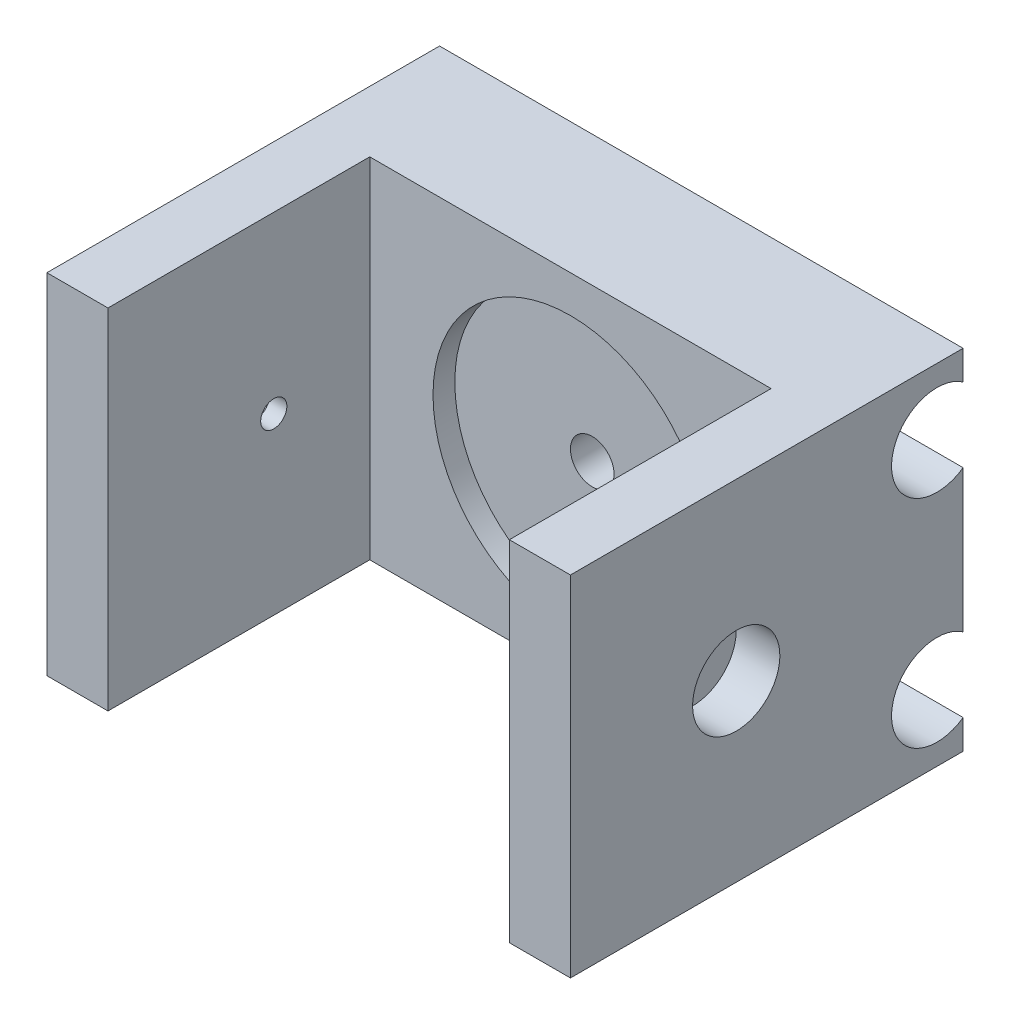
ISO-10303-21;
HEADER;
FILE_DESCRIPTION(('STEP AP214'),'2;1');
FILE_NAME('part.step','',(''),(''),'','','');
FILE_SCHEMA(('AUTOMOTIVE_DESIGN { 1 0 10303 214 1 1 1 1 }'));
ENDSEC;
DATA;
#1=APPLICATION_CONTEXT('core data for automotive mechanical design processes');
#2=APPLICATION_PROTOCOL_DEFINITION('international standard','automotive_design',2000,#1);
#3=PRODUCT_CONTEXT('',#1,'mechanical');
#4=PRODUCT('Part','Part','',(#3));
#5=PRODUCT_RELATED_PRODUCT_CATEGORY('part','',(#4));
#6=PRODUCT_DEFINITION_FORMATION('','',#4);
#7=PRODUCT_DEFINITION_CONTEXT('part definition',#1,'design');
#8=PRODUCT_DEFINITION('design','',#6,#7);
#9=PRODUCT_DEFINITION_SHAPE('','',#8);
#10=(LENGTH_UNIT() NAMED_UNIT(*) SI_UNIT(.MILLI.,.METRE.));
#11=(NAMED_UNIT(*) PLANE_ANGLE_UNIT() SI_UNIT($,.RADIAN.));
#12=(NAMED_UNIT(*) SI_UNIT($,.STERADIAN.) SOLID_ANGLE_UNIT());
#13=UNCERTAINTY_MEASURE_WITH_UNIT(LENGTH_MEASURE(1.E-05),#10,'distance_accuracy_value','');
#14=(GEOMETRIC_REPRESENTATION_CONTEXT(3) GLOBAL_UNCERTAINTY_ASSIGNED_CONTEXT((#13)) GLOBAL_UNIT_ASSIGNED_CONTEXT((#10,
#11,#12)) REPRESENTATION_CONTEXT('',''));
#15=CARTESIAN_POINT('',(0.,0.,0.));
#16=DIRECTION('',(0.,0.,1.));
#17=DIRECTION('',(1.,0.,0.));
#18=AXIS2_PLACEMENT_3D('',#15,#16,#17);
#19=CARTESIAN_POINT('',(12.2222222222222,0.915032679738576,45.));
#20=DIRECTION('',(0.,0.,-1.));
#21=DIRECTION('',(-1.,0.,0.));
#22=AXIS2_PLACEMENT_3D('',#19,#20,#21);
#23=CYLINDRICAL_SURFACE('',#22,2.5);
#24=CARTESIAN_POINT('',(12.2222222222222,0.915032679738576,4.));
#25=DIRECTION('',(0.,0.,-1.));
#26=DIRECTION('',(-1.,0.,0.));
#27=AXIS2_PLACEMENT_3D('',#24,#25,#26);
#28=CIRCLE('',#27,2.5);
#29=CARTESIAN_POINT('',(9.72222222222224,0.915032679738576,4.));
#30=VERTEX_POINT('',#29);
#31=EDGE_CURVE('E277',#30,#30,#28,.T.);
#32=ORIENTED_EDGE('',*,*,#31,.T.);
#33=EDGE_LOOP('',(#32));
#34=FACE_BOUND('',#33,.T.);
#35=CARTESIAN_POINT('',(12.2222222222222,0.915032679738576,12.5));
#36=DIRECTION('',(0.,0.,1.));
#37=DIRECTION('',(1.,0.,0.));
#38=AXIS2_PLACEMENT_3D('',#35,#36,#37);
#39=CIRCLE('',#38,2.5);
#40=CARTESIAN_POINT('',(14.7222222222222,0.915032679738576,12.5));
#41=VERTEX_POINT('',#40);
#42=EDGE_CURVE('E274',#41,#41,#39,.F.);
#43=ORIENTED_EDGE('',*,*,#42,.F.);
#44=EDGE_LOOP('',(#43));
#45=FACE_BOUND('',#44,.T.);
#46=ADVANCED_FACE('F49',(#34,#45),#23,.F.);
#47=CARTESIAN_POINT('',(0.,0.,0.));
#48=DIRECTION('',(0.,0.,1.));
#49=DIRECTION('',(1.,0.,0.));
#50=AXIS2_PLACEMENT_3D('',#47,#48,#49);
#51=PLANE('',#50);
#52=DIRECTION('',(0.,-1.,0.));
#53=VECTOR('',#52,1.);
#54=CARTESIAN_POINT('',(-17.7777777777778,20.9150326797386,0.));
#55=LINE('',#54,#53);
#56=CARTESIAN_POINT('',(-17.7777777777778,-15.7323194365805,0.));
#57=VERTEX_POINT('',#56);
#58=CARTESIAN_POINT('',(-17.7777777777778,-19.0849673202614,0.));
#59=VERTEX_POINT('',#58);
#60=EDGE_CURVE('E148',#57,#59,#55,.T.);
#61=ORIENTED_EDGE('',*,*,#60,.F.);
#62=DIRECTION('',(1.,0.,0.));
#63=VECTOR('',#62,1.);
#64=CARTESIAN_POINT('',(-20.7777777777778,-15.7323194365805,0.));
#65=LINE('',#64,#63);
#66=CARTESIAN_POINT('',(42.2222222222222,-15.7323194365805,0.));
#67=VERTEX_POINT('',#66);
#68=EDGE_CURVE('E11',#57,#67,#65,.T.);
#69=ORIENTED_EDGE('',*,*,#68,.T.);
#70=DIRECTION('',(0.,1.,0.));
#71=VECTOR('',#70,1.);
#72=CARTESIAN_POINT('',(42.2222222222222,20.9150326797386,0.));
#73=LINE('',#72,#71);
#74=CARTESIAN_POINT('',(42.2222222222222,-19.0849673202614,0.));
#75=VERTEX_POINT('',#74);
#76=EDGE_CURVE('E249',#75,#67,#73,.T.);
#77=ORIENTED_EDGE('',*,*,#76,.F.);
#78=DIRECTION('',(1.,0.,0.));
#79=VECTOR('',#78,1.);
#80=CARTESIAN_POINT('',(-17.7777777777778,-19.0849673202614,0.));
#81=LINE('',#80,#79);
#82=EDGE_CURVE('E244',#59,#75,#81,.T.);
#83=ORIENTED_EDGE('',*,*,#82,.F.);
#84=EDGE_LOOP('',(#61,#69,#77,#83));
#85=FACE_BOUND('',#84,.T.);
#86=ADVANCED_FACE('F329',(#85),#51,.F.);
#87=CARTESIAN_POINT('',(12.2222222222222,0.915032679738576,0.));
#88=DIRECTION('',(0.,0.,-1.));
#89=DIRECTION('',(-1.,0.,0.));
#90=AXIS2_PLACEMENT_3D('',#87,#88,#89);
#91=CIRCLE('',#90,5.);
#92=CARTESIAN_POINT('',(7.22222222222224,0.915032679738576,0.));
#93=VERTEX_POINT('',#92);
#94=EDGE_CURVE('E284',#93,#93,#91,.T.);
#95=ORIENTED_EDGE('',*,*,#94,.F.);
#96=EDGE_LOOP('',(#95));
#97=FACE_BOUND('',#96,.T.);
#98=CARTESIAN_POINT('',(42.2222222222222,-7.23761520394236,0.));
#99=VERTEX_POINT('',#98);
#100=CARTESIAN_POINT('',(42.2222222222222,9.06768056341952,0.));
#101=VERTEX_POINT('',#100);
#102=EDGE_CURVE('E253',#99,#101,#73,.T.);
#103=ORIENTED_EDGE('',*,*,#102,.F.);
#104=DIRECTION('',(1.,0.,0.));
#105=VECTOR('',#104,1.);
#106=CARTESIAN_POINT('',(-20.7777777777778,-7.23761520394237,0.));
#107=LINE('',#106,#105);
#108=CARTESIAN_POINT('',(-17.7777777777778,-7.23761520394236,0.));
#109=VERTEX_POINT('',#108);
#110=EDGE_CURVE('E59',#99,#109,#107,.F.);
#111=ORIENTED_EDGE('',*,*,#110,.T.);
#112=CARTESIAN_POINT('',(-17.7777777777778,9.06768056341951,0.));
#113=VERTEX_POINT('',#112);
#114=EDGE_CURVE('E245',#113,#109,#55,.T.);
#115=ORIENTED_EDGE('',*,*,#114,.F.);
#116=DIRECTION('',(1.,0.,0.));
#117=VECTOR('',#116,1.);
#118=CARTESIAN_POINT('',(-20.7777777777778,9.06768056341951,0.));
#119=LINE('',#118,#117);
#120=EDGE_CURVE('E268',#113,#101,#119,.T.);
#121=ORIENTED_EDGE('',*,*,#120,.T.);
#122=EDGE_LOOP('',(#103,#111,#115,#121));
#123=FACE_BOUND('',#122,.T.);
#124=ADVANCED_FACE('F337',(#97,#123),#51,.F.);
#125=CARTESIAN_POINT('',(-17.7777777777778,20.9150326797386,15.));
#126=DIRECTION('',(1.,0.,0.));
#127=DIRECTION('',(0.,0.,-1.));
#128=AXIS2_PLACEMENT_3D('',#125,#126,#127);
#129=PLANE('',#128);
#130=CARTESIAN_POINT('',(-17.7777777777778,0.915032679738565,26.));
#131=DIRECTION('',(1.,0.,0.));
#132=DIRECTION('',(0.,1.,0.));
#133=AXIS2_PLACEMENT_3D('',#130,#131,#132);
#134=CIRCLE('',#133,5.);
#135=CARTESIAN_POINT('',(-17.7777777777778,5.91503267973857,26.));
#136=VERTEX_POINT('',#135);
#137=EDGE_CURVE('E302',#136,#136,#134,.T.);
#138=ORIENTED_EDGE('',*,*,#137,.T.);
#139=EDGE_LOOP('',(#138));
#140=FACE_BOUND('',#139,.T.);
#141=ORIENTED_EDGE('',*,*,#114,.T.);
#142=CARTESIAN_POINT('',(-17.7777777777778,-11.4849673202614,3.));
#143=DIRECTION('',(1.,0.,0.));
#144=DIRECTION('',(0.,0.,-1.));
#145=AXIS2_PLACEMENT_3D('',#142,#143,#144);
#146=CIRCLE('',#145,5.2);
#147=EDGE_CURVE('E230',#109,#57,#146,.T.);
#148=ORIENTED_EDGE('',*,*,#147,.T.);
#149=ORIENTED_EDGE('',*,*,#60,.T.);
#150=DIRECTION('',(0.,0.,-1.));
#151=VECTOR('',#150,1.);
#152=CARTESIAN_POINT('',(-17.7777777777778,-19.0849673202614,15.));
#153=LINE('',#152,#151);
#154=CARTESIAN_POINT('',(-17.7777777777778,-19.0849673202614,45.));
#155=VERTEX_POINT('',#154);
#156=EDGE_CURVE('E140',#155,#59,#153,.T.);
#157=ORIENTED_EDGE('',*,*,#156,.F.);
#158=DIRECTION('',(0.,1.,0.));
#159=VECTOR('',#158,1.);
#160=CARTESIAN_POINT('',(-17.7777777777778,20.9150326797386,45.));
#161=LINE('',#160,#159);
#162=CARTESIAN_POINT('',(-17.7777777777778,20.9150326797386,45.));
#163=VERTEX_POINT('',#162);
#164=EDGE_CURVE('E144',#155,#163,#161,.T.);
#165=ORIENTED_EDGE('',*,*,#164,.T.);
#166=DIRECTION('',(0.,0.,-1.));
#167=VECTOR('',#166,1.);
#168=CARTESIAN_POINT('',(-17.7777777777778,20.9150326797386,15.));
#169=LINE('',#168,#167);
#170=CARTESIAN_POINT('',(-17.7777777777778,20.9150326797386,0.));
#171=VERTEX_POINT('',#170);
#172=EDGE_CURVE('E239',#163,#171,#169,.T.);
#173=ORIENTED_EDGE('',*,*,#172,.T.);
#174=CARTESIAN_POINT('',(-17.7777777777778,17.5623847960576,0.));
#175=VERTEX_POINT('',#174);
#176=EDGE_CURVE('E240',#171,#175,#55,.T.);
#177=ORIENTED_EDGE('',*,*,#176,.T.);
#178=CARTESIAN_POINT('',(-17.7777777777778,13.3150326797386,3.));
#179=DIRECTION('',(1.,0.,0.));
#180=DIRECTION('',(0.,0.,-1.));
#181=AXIS2_PLACEMENT_3D('',#178,#179,#180);
#182=CIRCLE('',#181,5.2);
#183=EDGE_CURVE('E224',#175,#113,#182,.T.);
#184=ORIENTED_EDGE('',*,*,#183,.T.);
#185=EDGE_LOOP('',(#141,#148,#149,#157,#165,#173,#177,#184));
#186=FACE_BOUND('',#185,.T.);
#187=ADVANCED_FACE('F51',(#140,#186),#129,.F.);
#188=CARTESIAN_POINT('',(-17.7777777777778,-19.0849673202614,15.));
#189=DIRECTION('',(0.,1.,0.));
#190=DIRECTION('',(-1.,0.,0.));
#191=AXIS2_PLACEMENT_3D('',#188,#189,#190);
#192=PLANE('',#191);
#193=ORIENTED_EDGE('',*,*,#82,.T.);
#194=DIRECTION('',(0.,0.,-1.));
#195=VECTOR('',#194,1.);
#196=CARTESIAN_POINT('',(42.2222222222222,-19.0849673202614,15.));
#197=LINE('',#196,#195);
#198=CARTESIAN_POINT('',(42.2222222222222,-19.0849673202614,45.));
#199=VERTEX_POINT('',#198);
#200=EDGE_CURVE('E154',#199,#75,#197,.T.);
#201=ORIENTED_EDGE('',*,*,#200,.F.);
#202=DIRECTION('',(1.,0.,0.));
#203=VECTOR('',#202,1.);
#204=CARTESIAN_POINT('',(42.2222222222222,-19.0849673202614,45.));
#205=LINE('',#204,#203);
#206=CARTESIAN_POINT('',(35.2222222222222,-19.0849673202614,45.));
#207=VERTEX_POINT('',#206);
#208=EDGE_CURVE('E205',#207,#199,#205,.T.);
#209=ORIENTED_EDGE('',*,*,#208,.F.);
#210=DIRECTION('',(0.,0.,-1.));
#211=VECTOR('',#210,1.);
#212=CARTESIAN_POINT('',(35.2222222222222,-19.0849673202614,45.));
#213=LINE('',#212,#211);
#214=CARTESIAN_POINT('',(35.2222222222222,-19.0849673202614,15.));
#215=VERTEX_POINT('',#214);
#216=EDGE_CURVE('E209',#207,#215,#213,.T.);
#217=ORIENTED_EDGE('',*,*,#216,.T.);
#218=DIRECTION('',(1.,0.,0.));
#219=VECTOR('',#218,1.);
#220=CARTESIAN_POINT('',(-17.7777777777778,-19.0849673202614,15.));
#221=LINE('',#220,#219);
#222=CARTESIAN_POINT('',(-10.7777777777778,-19.0849673202614,15.));
#223=VERTEX_POINT('',#222);
#224=EDGE_CURVE('E233',#223,#215,#221,.T.);
#225=ORIENTED_EDGE('',*,*,#224,.F.);
#226=DIRECTION('',(0.,0.,-1.));
#227=VECTOR('',#226,1.);
#228=CARTESIAN_POINT('',(-10.7777777777778,-19.0849673202614,45.));
#229=LINE('',#228,#227);
#230=CARTESIAN_POINT('',(-10.7777777777778,-19.0849673202614,45.));
#231=VERTEX_POINT('',#230);
#232=EDGE_CURVE('E168',#231,#223,#229,.T.);
#233=ORIENTED_EDGE('',*,*,#232,.F.);
#234=DIRECTION('',(-1.,0.,0.));
#235=VECTOR('',#234,1.);
#236=CARTESIAN_POINT('',(-17.7777777777778,-19.0849673202614,45.));
#237=LINE('',#236,#235);
#238=EDGE_CURVE('E160',#231,#155,#237,.T.);
#239=ORIENTED_EDGE('',*,*,#238,.T.);
#240=ORIENTED_EDGE('',*,*,#156,.T.);
#241=EDGE_LOOP('',(#193,#201,#209,#217,#225,#233,#239,#240));
#242=FACE_BOUND('',#241,.T.);
#243=ADVANCED_FACE('F166',(#242),#192,.F.);
#244=CARTESIAN_POINT('',(42.2222222222222,20.9150326797386,15.));
#245=DIRECTION('',(-1.,0.,0.));
#246=DIRECTION('',(0.,-1.,0.));
#247=AXIS2_PLACEMENT_3D('',#244,#245,#246);
#248=PLANE('',#247);
#249=CARTESIAN_POINT('',(42.2222222222222,0.915032679738576,26.));
#250=DIRECTION('',(1.,0.,0.));
#251=DIRECTION('',(0.,1.,0.));
#252=AXIS2_PLACEMENT_3D('',#249,#250,#251);
#253=CIRCLE('',#252,5.);
#254=CARTESIAN_POINT('',(42.2222222222222,5.91503267973858,26.));
#255=VERTEX_POINT('',#254);
#256=EDGE_CURVE('E186',#255,#255,#253,.T.);
#257=ORIENTED_EDGE('',*,*,#256,.F.);
#258=EDGE_LOOP('',(#257));
#259=FACE_BOUND('',#258,.T.);
#260=ORIENTED_EDGE('',*,*,#76,.T.);
#261=CARTESIAN_POINT('',(42.2222222222222,-11.4849673202614,3.));
#262=DIRECTION('',(1.,0.,0.));
#263=DIRECTION('',(0.,1.,0.));
#264=AXIS2_PLACEMENT_3D('',#261,#262,#263);
#265=CIRCLE('',#264,5.2);
#266=EDGE_CURVE('E221',#99,#67,#265,.T.);
#267=ORIENTED_EDGE('',*,*,#266,.F.);
#268=ORIENTED_EDGE('',*,*,#102,.T.);
#269=CARTESIAN_POINT('',(42.2222222222222,13.3150326797386,3.));
#270=DIRECTION('',(1.,0.,0.));
#271=DIRECTION('',(0.,1.,0.));
#272=AXIS2_PLACEMENT_3D('',#269,#270,#271);
#273=CIRCLE('',#272,5.2);
#274=CARTESIAN_POINT('',(42.2222222222222,17.5623847960576,0.));
#275=VERTEX_POINT('',#274);
#276=EDGE_CURVE('E220',#275,#101,#273,.T.);
#277=ORIENTED_EDGE('',*,*,#276,.F.);
#278=CARTESIAN_POINT('',(42.2222222222222,20.9150326797386,0.));
#279=VERTEX_POINT('',#278);
#280=EDGE_CURVE('E248',#275,#279,#73,.T.);
#281=ORIENTED_EDGE('',*,*,#280,.T.);
#282=DIRECTION('',(0.,0.,-1.));
#283=VECTOR('',#282,1.);
#284=CARTESIAN_POINT('',(42.2222222222222,20.9150326797386,15.));
#285=LINE('',#284,#283);
#286=CARTESIAN_POINT('',(42.2222222222222,20.9150326797386,45.));
#287=VERTEX_POINT('',#286);
#288=EDGE_CURVE('E258',#287,#279,#285,.T.);
#289=ORIENTED_EDGE('',*,*,#288,.F.);
#290=DIRECTION('',(0.,1.,0.));
#291=VECTOR('',#290,1.);
#292=CARTESIAN_POINT('',(42.2222222222222,20.9150326797386,45.));
#293=LINE('',#292,#291);
#294=EDGE_CURVE('E195',#199,#287,#293,.T.);
#295=ORIENTED_EDGE('',*,*,#294,.F.);
#296=ORIENTED_EDGE('',*,*,#200,.T.);
#297=EDGE_LOOP('',(#260,#267,#268,#277,#281,#289,#295,#296));
#298=FACE_BOUND('',#297,.T.);
#299=ADVANCED_FACE('F368',(#259,#298),#248,.F.);
#300=CARTESIAN_POINT('',(-17.7777777777778,20.9150326797386,15.));
#301=DIRECTION('',(0.,-1.,0.));
#302=DIRECTION('',(0.,0.,-1.));
#303=AXIS2_PLACEMENT_3D('',#300,#301,#302);
#304=PLANE('',#303);
#305=DIRECTION('',(-1.,0.,0.));
#306=VECTOR('',#305,1.);
#307=CARTESIAN_POINT('',(-17.7777777777778,20.9150326797386,0.));
#308=LINE('',#307,#306);
#309=EDGE_CURVE('E236',#279,#171,#308,.T.);
#310=ORIENTED_EDGE('',*,*,#309,.T.);
#311=ORIENTED_EDGE('',*,*,#172,.F.);
#312=DIRECTION('',(1.,0.,0.));
#313=VECTOR('',#312,1.);
#314=CARTESIAN_POINT('',(-17.7777777777778,20.9150326797386,45.));
#315=LINE('',#314,#313);
#316=CARTESIAN_POINT('',(-10.7777777777778,20.9150326797386,45.));
#317=VERTEX_POINT('',#316);
#318=EDGE_CURVE('E163',#163,#317,#315,.T.);
#319=ORIENTED_EDGE('',*,*,#318,.T.);
#320=DIRECTION('',(0.,0.,-1.));
#321=VECTOR('',#320,1.);
#322=CARTESIAN_POINT('',(-10.7777777777778,20.9150326797386,45.));
#323=LINE('',#322,#321);
#324=CARTESIAN_POINT('',(-10.7777777777778,20.9150326797386,15.));
#325=VERTEX_POINT('',#324);
#326=EDGE_CURVE('E178',#317,#325,#323,.T.);
#327=ORIENTED_EDGE('',*,*,#326,.T.);
#328=DIRECTION('',(-1.,0.,0.));
#329=VECTOR('',#328,1.);
#330=CARTESIAN_POINT('',(-17.7777777777778,20.9150326797386,15.));
#331=LINE('',#330,#329);
#332=CARTESIAN_POINT('',(35.2222222222222,20.9150326797386,15.));
#333=VERTEX_POINT('',#332);
#334=EDGE_CURVE('E72',#333,#325,#331,.T.);
#335=ORIENTED_EDGE('',*,*,#334,.F.);
#336=DIRECTION('',(0.,0.,-1.));
#337=VECTOR('',#336,1.);
#338=CARTESIAN_POINT('',(35.2222222222222,20.9150326797386,45.));
#339=LINE('',#338,#337);
#340=CARTESIAN_POINT('',(35.2222222222222,20.9150326797386,45.));
#341=VERTEX_POINT('',#340);
#342=EDGE_CURVE('E216',#341,#333,#339,.T.);
#343=ORIENTED_EDGE('',*,*,#342,.F.);
#344=DIRECTION('',(-1.,0.,0.));
#345=VECTOR('',#344,1.);
#346=CARTESIAN_POINT('',(42.2222222222222,20.9150326797386,45.));
#347=LINE('',#346,#345);
#348=EDGE_CURVE('E199',#287,#341,#347,.T.);
#349=ORIENTED_EDGE('',*,*,#348,.F.);
#350=ORIENTED_EDGE('',*,*,#288,.T.);
#351=EDGE_LOOP('',(#310,#311,#319,#327,#335,#343,#349,#350));
#352=FACE_BOUND('',#351,.T.);
#353=ADVANCED_FACE('F374',(#352),#304,.F.);
#354=CARTESIAN_POINT('',(0.,0.,15.));
#355=DIRECTION('',(0.,0.,1.));
#356=DIRECTION('',(1.,0.,0.));
#357=AXIS2_PLACEMENT_3D('',#354,#355,#356);
#358=PLANE('',#357);
#359=CARTESIAN_POINT('',(12.2222222222222,0.915032679738576,15.));
#360=DIRECTION('',(0.,0.,1.));
#361=DIRECTION('',(1.,0.,0.));
#362=AXIS2_PLACEMENT_3D('',#359,#360,#361);
#363=CIRCLE('',#362,15.75);
#364=CARTESIAN_POINT('',(27.9722222222222,0.915032679738576,15.));
#365=VERTEX_POINT('',#364);
#366=EDGE_CURVE('E287',#365,#365,#363,.T.);
#367=ORIENTED_EDGE('',*,*,#366,.F.);
#368=EDGE_LOOP('',(#367));
#369=FACE_BOUND('',#368,.T.);
#370=DIRECTION('',(0.,-1.,0.));
#371=VECTOR('',#370,1.);
#372=CARTESIAN_POINT('',(-10.7777777777778,20.9150326797386,15.));
#373=LINE('',#372,#371);
#374=EDGE_CURVE('E67',#325,#223,#373,.T.);
#375=ORIENTED_EDGE('',*,*,#374,.T.);
#376=ORIENTED_EDGE('',*,*,#224,.T.);
#377=DIRECTION('',(0.,-1.,0.));
#378=VECTOR('',#377,1.);
#379=CARTESIAN_POINT('',(35.2222222222222,20.9150326797386,15.));
#380=LINE('',#379,#378);
#381=EDGE_CURVE('E191',#333,#215,#380,.T.);
#382=ORIENTED_EDGE('',*,*,#381,.F.);
#383=ORIENTED_EDGE('',*,*,#334,.T.);
#384=EDGE_LOOP('',(#375,#376,#382,#383));
#385=FACE_BOUND('',#384,.T.);
#386=ADVANCED_FACE('F409',(#369,#385),#358,.T.);
#387=ORIENTED_EDGE('',*,*,#280,.F.);
#388=DIRECTION('',(1.,0.,0.));
#389=VECTOR('',#388,1.);
#390=CARTESIAN_POINT('',(-20.7777777777778,17.5623847960576,0.));
#391=LINE('',#390,#389);
#392=EDGE_CURVE('E153',#275,#175,#391,.F.);
#393=ORIENTED_EDGE('',*,*,#392,.T.);
#394=ORIENTED_EDGE('',*,*,#176,.F.);
#395=ORIENTED_EDGE('',*,*,#309,.F.);
#396=EDGE_LOOP('',(#387,#393,#394,#395));
#397=FACE_BOUND('',#396,.T.);
#398=ADVANCED_FACE('F340',(#397),#51,.F.);
#399=CARTESIAN_POINT('',(-20.7777777777778,13.3150326797386,3.));
#400=DIRECTION('',(1.,0.,0.));
#401=DIRECTION('',(0.,1.,0.));
#402=AXIS2_PLACEMENT_3D('',#399,#400,#401);
#403=CYLINDRICAL_SURFACE('',#402,5.2);
#404=ORIENTED_EDGE('',*,*,#183,.F.);
#405=ORIENTED_EDGE('',*,*,#392,.F.);
#406=ORIENTED_EDGE('',*,*,#276,.T.);
#407=ORIENTED_EDGE('',*,*,#120,.F.);
#408=EDGE_LOOP('',(#404,#405,#406,#407));
#409=FACE_BOUND('',#408,.T.);
#410=ADVANCED_FACE('F404',(#409),#403,.F.);
#411=CARTESIAN_POINT('',(-20.7777777777778,-11.4849673202614,3.));
#412=DIRECTION('',(1.,0.,0.));
#413=DIRECTION('',(0.,1.,0.));
#414=AXIS2_PLACEMENT_3D('',#411,#412,#413);
#415=CYLINDRICAL_SURFACE('',#414,5.2);
#416=ORIENTED_EDGE('',*,*,#147,.F.);
#417=ORIENTED_EDGE('',*,*,#110,.F.);
#418=ORIENTED_EDGE('',*,*,#266,.T.);
#419=ORIENTED_EDGE('',*,*,#68,.F.);
#420=EDGE_LOOP('',(#416,#417,#418,#419));
#421=FACE_BOUND('',#420,.T.);
#422=ADVANCED_FACE('F400',(#421),#415,.F.);
#423=CARTESIAN_POINT('',(35.2222222222222,20.9150326797386,45.));
#424=DIRECTION('',(1.,0.,0.));
#425=DIRECTION('',(0.,1.,0.));
#426=AXIS2_PLACEMENT_3D('',#423,#424,#425);
#427=PLANE('',#426);
#428=CARTESIAN_POINT('',(35.2222222222222,0.915032679738574,26.));
#429=DIRECTION('',(1.,0.,0.));
#430=DIRECTION('',(0.,1.,0.));
#431=AXIS2_PLACEMENT_3D('',#428,#429,#430);
#432=CIRCLE('',#431,1.5);
#433=CARTESIAN_POINT('',(35.2222222222222,2.41503267973858,26.));
#434=VERTEX_POINT('',#433);
#435=EDGE_CURVE('E293',#434,#434,#432,.T.);
#436=ORIENTED_EDGE('',*,*,#435,.T.);
#437=EDGE_LOOP('',(#436));
#438=FACE_BOUND('',#437,.T.);
#439=ORIENTED_EDGE('',*,*,#381,.T.);
#440=ORIENTED_EDGE('',*,*,#216,.F.);
#441=DIRECTION('',(0.,-1.,0.));
#442=VECTOR('',#441,1.);
#443=CARTESIAN_POINT('',(35.2222222222222,20.9150326797386,45.));
#444=LINE('',#443,#442);
#445=EDGE_CURVE('E202',#341,#207,#444,.T.);
#446=ORIENTED_EDGE('',*,*,#445,.F.);
#447=ORIENTED_EDGE('',*,*,#342,.T.);
#448=EDGE_LOOP('',(#439,#440,#446,#447));
#449=FACE_BOUND('',#448,.T.);
#450=ADVANCED_FACE('F396',(#438,#449),#427,.F.);
#451=CARTESIAN_POINT('',(0.,0.,45.));
#452=DIRECTION('',(0.,0.,-1.));
#453=DIRECTION('',(-1.,0.,0.));
#454=AXIS2_PLACEMENT_3D('',#451,#452,#453);
#455=PLANE('',#454);
#456=ORIENTED_EDGE('',*,*,#294,.T.);
#457=ORIENTED_EDGE('',*,*,#348,.T.);
#458=ORIENTED_EDGE('',*,*,#445,.T.);
#459=ORIENTED_EDGE('',*,*,#208,.T.);
#460=EDGE_LOOP('',(#456,#457,#458,#459));
#461=FACE_BOUND('',#460,.T.);
#462=ADVANCED_FACE('F392',(#461),#455,.F.);
#463=CARTESIAN_POINT('',(37.2222222222222,0.915032679738575,26.));
#464=DIRECTION('',(1.,0.,0.));
#465=DIRECTION('',(0.,1.,0.));
#466=AXIS2_PLACEMENT_3D('',#463,#464,#465);
#467=CYLINDRICAL_SURFACE('',#466,5.);
#468=CARTESIAN_POINT('',(37.2222222222222,0.915032679738575,26.));
#469=DIRECTION('',(1.,0.,0.));
#470=DIRECTION('',(0.,1.,0.));
#471=AXIS2_PLACEMENT_3D('',#468,#469,#470);
#472=CIRCLE('',#471,5.);
#473=CARTESIAN_POINT('',(37.2222222222222,5.91503267973857,26.));
#474=VERTEX_POINT('',#473);
#475=EDGE_CURVE('E187',#474,#474,#472,.T.);
#476=ORIENTED_EDGE('',*,*,#475,.F.);
#477=EDGE_LOOP('',(#476));
#478=FACE_BOUND('',#477,.T.);
#479=ORIENTED_EDGE('',*,*,#256,.T.);
#480=EDGE_LOOP('',(#479));
#481=FACE_BOUND('',#480,.T.);
#482=ADVANCED_FACE('F385',(#478,#481),#467,.F.);
#483=CARTESIAN_POINT('',(37.2222222222222,0.915032679738575,26.));
#484=DIRECTION('',(1.,0.,0.));
#485=DIRECTION('',(0.,1.,0.));
#486=AXIS2_PLACEMENT_3D('',#483,#484,#485);
#487=PLANE('',#486);
#488=CARTESIAN_POINT('',(37.2222222222222,0.915032679738575,26.));
#489=DIRECTION('',(1.,0.,0.));
#490=DIRECTION('',(0.,1.,0.));
#491=AXIS2_PLACEMENT_3D('',#488,#489,#490);
#492=CIRCLE('',#491,1.5);
#493=CARTESIAN_POINT('',(37.2222222222222,2.41503267973858,26.));
#494=VERTEX_POINT('',#493);
#495=EDGE_CURVE('E567',#494,#494,#492,.T.);
#496=ORIENTED_EDGE('',*,*,#495,.F.);
#497=EDGE_LOOP('',(#496));
#498=FACE_BOUND('',#497,.T.);
#499=ORIENTED_EDGE('',*,*,#475,.T.);
#500=EDGE_LOOP('',(#499));
#501=FACE_BOUND('',#500,.T.);
#502=ADVANCED_FACE('F379',(#498,#501),#487,.T.);
#503=CARTESIAN_POINT('',(-10.7777777777778,20.9150326797386,45.));
#504=DIRECTION('',(1.,0.,0.));
#505=DIRECTION('',(0.,1.,0.));
#506=AXIS2_PLACEMENT_3D('',#503,#504,#505);
#507=PLANE('',#506);
#508=CARTESIAN_POINT('',(-10.7777777777778,0.915032679738567,26.));
#509=DIRECTION('',(1.,0.,0.));
#510=DIRECTION('',(0.,1.,0.));
#511=AXIS2_PLACEMENT_3D('',#508,#509,#510);
#512=CIRCLE('',#511,1.5);
#513=CARTESIAN_POINT('',(-10.7777777777778,2.41503267973857,26.));
#514=VERTEX_POINT('',#513);
#515=EDGE_CURVE('E572',#514,#514,#512,.T.);
#516=ORIENTED_EDGE('',*,*,#515,.F.);
#517=EDGE_LOOP('',(#516));
#518=FACE_BOUND('',#517,.T.);
#519=ORIENTED_EDGE('',*,*,#374,.F.);
#520=ORIENTED_EDGE('',*,*,#326,.F.);
#521=DIRECTION('',(0.,-1.,0.));
#522=VECTOR('',#521,1.);
#523=CARTESIAN_POINT('',(-10.7777777777778,20.9150326797386,45.));
#524=LINE('',#523,#522);
#525=EDGE_CURVE('E170',#317,#231,#524,.T.);
#526=ORIENTED_EDGE('',*,*,#525,.T.);
#527=ORIENTED_EDGE('',*,*,#232,.T.);
#528=EDGE_LOOP('',(#519,#520,#526,#527));
#529=FACE_BOUND('',#528,.T.);
#530=ADVANCED_FACE('F326',(#518,#529),#507,.T.);
#531=CARTESIAN_POINT('',(24.4444444444445,0.,45.));
#532=DIRECTION('',(0.,0.,-1.));
#533=DIRECTION('',(1.,0.,0.));
#534=AXIS2_PLACEMENT_3D('',#531,#532,#533);
#535=PLANE('',#534);
#536=ORIENTED_EDGE('',*,*,#164,.F.);
#537=ORIENTED_EDGE('',*,*,#238,.F.);
#538=ORIENTED_EDGE('',*,*,#525,.F.);
#539=ORIENTED_EDGE('',*,*,#318,.F.);
#540=EDGE_LOOP('',(#536,#537,#538,#539));
#541=FACE_BOUND('',#540,.T.);
#542=ADVANCED_FACE('F158',(#541),#535,.F.);
#543=CARTESIAN_POINT('',(-12.7777777777778,0.915032679738566,26.));
#544=DIRECTION('',(-1.,0.,0.));
#545=DIRECTION('',(0.,-1.,0.));
#546=AXIS2_PLACEMENT_3D('',#543,#544,#545);
#547=CYLINDRICAL_SURFACE('',#546,5.);
#548=CARTESIAN_POINT('',(-12.7777777777778,0.915032679738566,26.));
#549=DIRECTION('',(1.,0.,0.));
#550=DIRECTION('',(0.,1.,0.));
#551=AXIS2_PLACEMENT_3D('',#548,#549,#550);
#552=CIRCLE('',#551,5.);
#553=CARTESIAN_POINT('',(-12.7777777777778,5.91503267973857,26.));
#554=VERTEX_POINT('',#553);
#555=EDGE_CURVE('E181',#554,#554,#552,.T.);
#556=ORIENTED_EDGE('',*,*,#555,.T.);
#557=EDGE_LOOP('',(#556));
#558=FACE_BOUND('',#557,.T.);
#559=ORIENTED_EDGE('',*,*,#137,.F.);
#560=EDGE_LOOP('',(#559));
#561=FACE_BOUND('',#560,.T.);
#562=ADVANCED_FACE('F313',(#558,#561),#547,.F.);
#563=CARTESIAN_POINT('',(-12.7777777777778,0.915032679738566,26.));
#564=DIRECTION('',(-1.,0.,0.));
#565=DIRECTION('',(0.,1.,0.));
#566=AXIS2_PLACEMENT_3D('',#563,#564,#565);
#567=PLANE('',#566);
#568=CARTESIAN_POINT('',(-12.7777777777778,0.915032679738566,26.));
#569=DIRECTION('',(-1.,0.,0.));
#570=DIRECTION('',(0.,-1.,0.));
#571=AXIS2_PLACEMENT_3D('',#568,#569,#570);
#572=CIRCLE('',#571,1.5);
#573=CARTESIAN_POINT('',(-12.7777777777778,-0.584967320261434,26.));
#574=VERTEX_POINT('',#573);
#575=EDGE_CURVE('E53',#574,#574,#572,.T.);
#576=ORIENTED_EDGE('',*,*,#575,.F.);
#577=EDGE_LOOP('',(#576));
#578=FACE_BOUND('',#577,.T.);
#579=ORIENTED_EDGE('',*,*,#555,.F.);
#580=EDGE_LOOP('',(#579));
#581=FACE_BOUND('',#580,.T.);
#582=ADVANCED_FACE('F315',(#578,#581),#567,.T.);
#583=CARTESIAN_POINT('',(12.2222222222222,0.915032679738576,4.));
#584=DIRECTION('',(0.,0.,-1.));
#585=DIRECTION('',(-1.,0.,0.));
#586=AXIS2_PLACEMENT_3D('',#583,#584,#585);
#587=CYLINDRICAL_SURFACE('',#586,5.);
#588=CARTESIAN_POINT('',(12.2222222222222,0.915032679738576,4.));
#589=DIRECTION('',(0.,0.,-1.));
#590=DIRECTION('',(-1.,0.,0.));
#591=AXIS2_PLACEMENT_3D('',#588,#589,#590);
#592=CIRCLE('',#591,5.);
#593=CARTESIAN_POINT('',(7.22222222222224,0.915032679738576,4.));
#594=VERTEX_POINT('',#593);
#595=EDGE_CURVE('E298',#594,#594,#592,.T.);
#596=ORIENTED_EDGE('',*,*,#595,.F.);
#597=EDGE_LOOP('',(#596));
#598=FACE_BOUND('',#597,.T.);
#599=ORIENTED_EDGE('',*,*,#94,.T.);
#600=EDGE_LOOP('',(#599));
#601=FACE_BOUND('',#600,.T.);
#602=ADVANCED_FACE('F323',(#598,#601),#587,.F.);
#603=CARTESIAN_POINT('',(12.2222222222222,0.915032679738576,4.));
#604=DIRECTION('',(0.,0.,-1.));
#605=DIRECTION('',(-1.,0.,0.));
#606=AXIS2_PLACEMENT_3D('',#603,#604,#605);
#607=PLANE('',#606);
#608=ORIENTED_EDGE('',*,*,#31,.F.);
#609=EDGE_LOOP('',(#608));
#610=FACE_BOUND('',#609,.T.);
#611=ORIENTED_EDGE('',*,*,#595,.T.);
#612=EDGE_LOOP('',(#611));
#613=FACE_BOUND('',#612,.T.);
#614=ADVANCED_FACE('F346',(#610,#613),#607,.T.);
#615=CARTESIAN_POINT('',(12.2222222222222,0.915032679738576,12.5));
#616=DIRECTION('',(0.,0.,1.));
#617=DIRECTION('',(1.,0.,0.));
#618=AXIS2_PLACEMENT_3D('',#615,#616,#617);
#619=PLANE('',#618);
#620=CARTESIAN_POINT('',(12.2222222222222,0.915032679738576,12.5));
#621=DIRECTION('',(0.,0.,1.));
#622=DIRECTION('',(1.,0.,0.));
#623=AXIS2_PLACEMENT_3D('',#620,#621,#622);
#624=CIRCLE('',#623,15.75);
#625=CARTESIAN_POINT('',(27.9722222222222,0.915032679738576,12.5));
#626=VERTEX_POINT('',#625);
#627=EDGE_CURVE('E278',#626,#626,#624,.T.);
#628=ORIENTED_EDGE('',*,*,#627,.T.);
#629=EDGE_LOOP('',(#628));
#630=FACE_BOUND('',#629,.T.);
#631=ORIENTED_EDGE('',*,*,#42,.T.);
#632=EDGE_LOOP('',(#631));
#633=FACE_BOUND('',#632,.T.);
#634=ADVANCED_FACE('F348',(#630,#633),#619,.T.);
#635=CARTESIAN_POINT('',(12.2222222222222,0.915032679738576,12.5));
#636=DIRECTION('',(0.,0.,1.));
#637=DIRECTION('',(1.,0.,0.));
#638=AXIS2_PLACEMENT_3D('',#635,#636,#637);
#639=CYLINDRICAL_SURFACE('',#638,15.75);
#640=ORIENTED_EDGE('',*,*,#627,.F.);
#641=EDGE_LOOP('',(#640));
#642=FACE_BOUND('',#641,.T.);
#643=ORIENTED_EDGE('',*,*,#366,.T.);
#644=EDGE_LOOP('',(#643));
#645=FACE_BOUND('',#644,.T.);
#646=ADVANCED_FACE('F344',(#642,#645),#639,.F.);
#647=CARTESIAN_POINT('',(42.2222222222222,0.915032679738576,26.));
#648=DIRECTION('',(-1.,0.,0.));
#649=DIRECTION('',(0.,-1.,0.));
#650=AXIS2_PLACEMENT_3D('',#647,#648,#649);
#651=CYLINDRICAL_SURFACE('',#650,1.5);
#652=ORIENTED_EDGE('',*,*,#515,.T.);
#653=EDGE_LOOP('',(#652));
#654=FACE_BOUND('',#653,.T.);
#655=ORIENTED_EDGE('',*,*,#575,.T.);
#656=EDGE_LOOP('',(#655));
#657=FACE_BOUND('',#656,.T.);
#658=ADVANCED_FACE('F497',(#654,#657),#651,.F.);
#659=ORIENTED_EDGE('',*,*,#495,.T.);
#660=EDGE_LOOP('',(#659));
#661=FACE_BOUND('',#660,.T.);
#662=ORIENTED_EDGE('',*,*,#435,.F.);
#663=EDGE_LOOP('',(#662));
#664=FACE_BOUND('',#663,.T.);
#665=ADVANCED_FACE('F550',(#661,#664),#651,.F.);
#666=CLOSED_SHELL('',(#46,#86,#124,#187,#243,#299,#353,#386,#398,#410,#422,#450,#462,#482,#502,
#530,#542,#562,#582,#602,#614,#634,#646,#658,#665));
#667=MANIFOLD_SOLID_BREP('B2',#666);
#668=ADVANCED_BREP_SHAPE_REPRESENTATION('',(#18,#667),#14);
#669=SHAPE_DEFINITION_REPRESENTATION(#9,#668);
ENDSEC;
END-ISO-10303-21;
